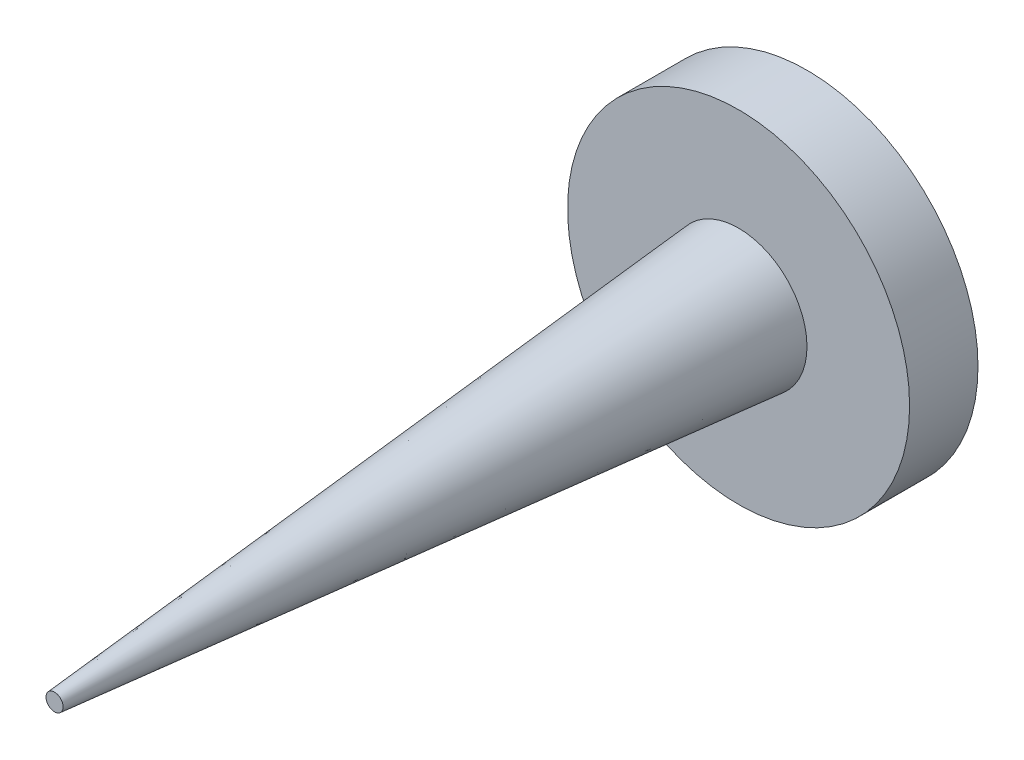
ISO-10303-21;
HEADER;
FILE_DESCRIPTION(('STEP AP214'),'2;1');
FILE_NAME('part.step','',(''),(''),'','','');
FILE_SCHEMA(('AUTOMOTIVE_DESIGN { 1 0 10303 214 1 1 1 1 }'));
ENDSEC;
DATA;
#1=APPLICATION_CONTEXT('core data for automotive mechanical design processes');
#2=APPLICATION_PROTOCOL_DEFINITION('international standard','automotive_design',2000,#1);
#3=PRODUCT_CONTEXT('',#1,'mechanical');
#4=PRODUCT('Part','Part','',(#3));
#5=PRODUCT_RELATED_PRODUCT_CATEGORY('part','',(#4));
#6=PRODUCT_DEFINITION_FORMATION('','',#4);
#7=PRODUCT_DEFINITION_CONTEXT('part definition',#1,'design');
#8=PRODUCT_DEFINITION('design','',#6,#7);
#9=PRODUCT_DEFINITION_SHAPE('','',#8);
#10=(LENGTH_UNIT() NAMED_UNIT(*) SI_UNIT(.MILLI.,.METRE.));
#11=(NAMED_UNIT(*) PLANE_ANGLE_UNIT() SI_UNIT($,.RADIAN.));
#12=(NAMED_UNIT(*) SI_UNIT($,.STERADIAN.) SOLID_ANGLE_UNIT());
#13=UNCERTAINTY_MEASURE_WITH_UNIT(LENGTH_MEASURE(1.E-05),#10,'distance_accuracy_value','');
#14=(GEOMETRIC_REPRESENTATION_CONTEXT(3) GLOBAL_UNCERTAINTY_ASSIGNED_CONTEXT((#13)) GLOBAL_UNIT_ASSIGNED_CONTEXT((#10,
#11,#12)) REPRESENTATION_CONTEXT('',''));
#15=CARTESIAN_POINT('',(0.,0.,0.));
#16=DIRECTION('',(0.,0.,1.));
#17=DIRECTION('',(1.,0.,0.));
#18=AXIS2_PLACEMENT_3D('',#15,#16,#17);
#19=CARTESIAN_POINT('',(0.,0.,1.));
#20=DIRECTION('',(0.,0.,1.));
#21=DIRECTION('',(1.,0.,0.));
#22=AXIS2_PLACEMENT_3D('',#19,#20,#21);
#23=PLANE('',#22);
#24=CARTESIAN_POINT('',(0.,0.,1.));
#25=DIRECTION('',(0.,0.,1.));
#26=DIRECTION('',(1.,0.,0.));
#27=AXIS2_PLACEMENT_3D('',#24,#25,#26);
#28=CIRCLE('',#27,2.5);
#29=CARTESIAN_POINT('',(2.5,0.,1.));
#30=VERTEX_POINT('',#29);
#31=EDGE_CURVE('E10',#30,#30,#28,.T.);
#32=ORIENTED_EDGE('',*,*,#31,.T.);
#33=EDGE_LOOP('',(#32));
#34=FACE_BOUND('',#33,.T.);
#35=CARTESIAN_POINT('',(0.,0.,1.));
#36=DIRECTION('',(0.,0.,1.));
#37=DIRECTION('',(1.,0.,0.));
#38=AXIS2_PLACEMENT_3D('',#35,#36,#37);
#39=CIRCLE('',#38,1.);
#40=CARTESIAN_POINT('',(1.,0.,1.));
#41=VERTEX_POINT('',#40);
#42=EDGE_CURVE('E46',#41,#41,#39,.T.);
#43=ORIENTED_EDGE('',*,*,#42,.F.);
#44=EDGE_LOOP('',(#43));
#45=FACE_BOUND('',#44,.T.);
#46=ADVANCED_FACE('F31',(#34,#45),#23,.T.);
#47=CARTESIAN_POINT('',(0.,0.,1.));
#48=DIRECTION('',(0.,0.,-1.));
#49=DIRECTION('',(-1.,0.,0.));
#50=AXIS2_PLACEMENT_3D('',#47,#48,#49);
#51=CYLINDRICAL_SURFACE('',#50,2.5);
#52=ORIENTED_EDGE('',*,*,#31,.F.);
#53=EDGE_LOOP('',(#52));
#54=FACE_BOUND('',#53,.T.);
#55=CARTESIAN_POINT('',(0.,0.,0.));
#56=DIRECTION('',(0.,0.,1.));
#57=DIRECTION('',(1.,0.,0.));
#58=AXIS2_PLACEMENT_3D('',#55,#56,#57);
#59=CIRCLE('',#58,2.5);
#60=CARTESIAN_POINT('',(2.5,0.,0.));
#61=VERTEX_POINT('',#60);
#62=EDGE_CURVE('E35',#61,#61,#59,.T.);
#63=ORIENTED_EDGE('',*,*,#62,.T.);
#64=EDGE_LOOP('',(#63));
#65=FACE_BOUND('',#64,.T.);
#66=ADVANCED_FACE('F33',(#54,#65),#51,.T.);
#67=CARTESIAN_POINT('',(0.,0.,0.));
#68=DIRECTION('',(0.,0.,1.));
#69=DIRECTION('',(1.,0.,0.));
#70=AXIS2_PLACEMENT_3D('',#67,#68,#69);
#71=PLANE('',#70);
#72=ORIENTED_EDGE('',*,*,#62,.F.);
#73=EDGE_LOOP('',(#72));
#74=FACE_BOUND('',#73,.T.);
#75=ADVANCED_FACE('F57',(#74),#71,.F.);
#76=CARTESIAN_POINT('',(0.,0.,1.));
#77=DIRECTION('',(0.,0.,-1.));
#78=DIRECTION('',(1.,0.,0.));
#79=AXIS2_PLACEMENT_3D('',#76,#77,#78);
#80=CONICAL_SURFACE('',#79,1.,0.0872664625997165);
#81=CARTESIAN_POINT('',(0.,0.,11.));
#82=DIRECTION('',(0.,0.,1.));
#83=DIRECTION('',(1.,0.,0.));
#84=AXIS2_PLACEMENT_3D('',#81,#82,#83);
#85=CIRCLE('',#84,0.12511336474076);
#86=CARTESIAN_POINT('',(0.12511336474076,0.,11.));
#87=VERTEX_POINT('',#86);
#88=EDGE_CURVE('E42',#87,#87,#85,.T.);
#89=ORIENTED_EDGE('',*,*,#88,.F.);
#90=EDGE_LOOP('',(#89));
#91=FACE_BOUND('',#90,.T.);
#92=ORIENTED_EDGE('',*,*,#42,.T.);
#93=EDGE_LOOP('',(#92));
#94=FACE_BOUND('',#93,.T.);
#95=ADVANCED_FACE('F50',(#91,#94),#80,.T.);
#96=CARTESIAN_POINT('',(0.,0.,11.));
#97=DIRECTION('',(0.,0.,1.));
#98=DIRECTION('',(1.,0.,0.));
#99=AXIS2_PLACEMENT_3D('',#96,#97,#98);
#100=PLANE('',#99);
#101=ORIENTED_EDGE('',*,*,#88,.T.);
#102=EDGE_LOOP('',(#101));
#103=FACE_BOUND('',#102,.T.);
#104=ADVANCED_FACE('F66',(#103),#100,.T.);
#105=CLOSED_SHELL('',(#46,#66,#75,#95,#104));
#106=MANIFOLD_SOLID_BREP('B2',#105);
#107=ADVANCED_BREP_SHAPE_REPRESENTATION('',(#18,#106),#14);
#108=SHAPE_DEFINITION_REPRESENTATION(#9,#107);
ENDSEC;
END-ISO-10303-21;
